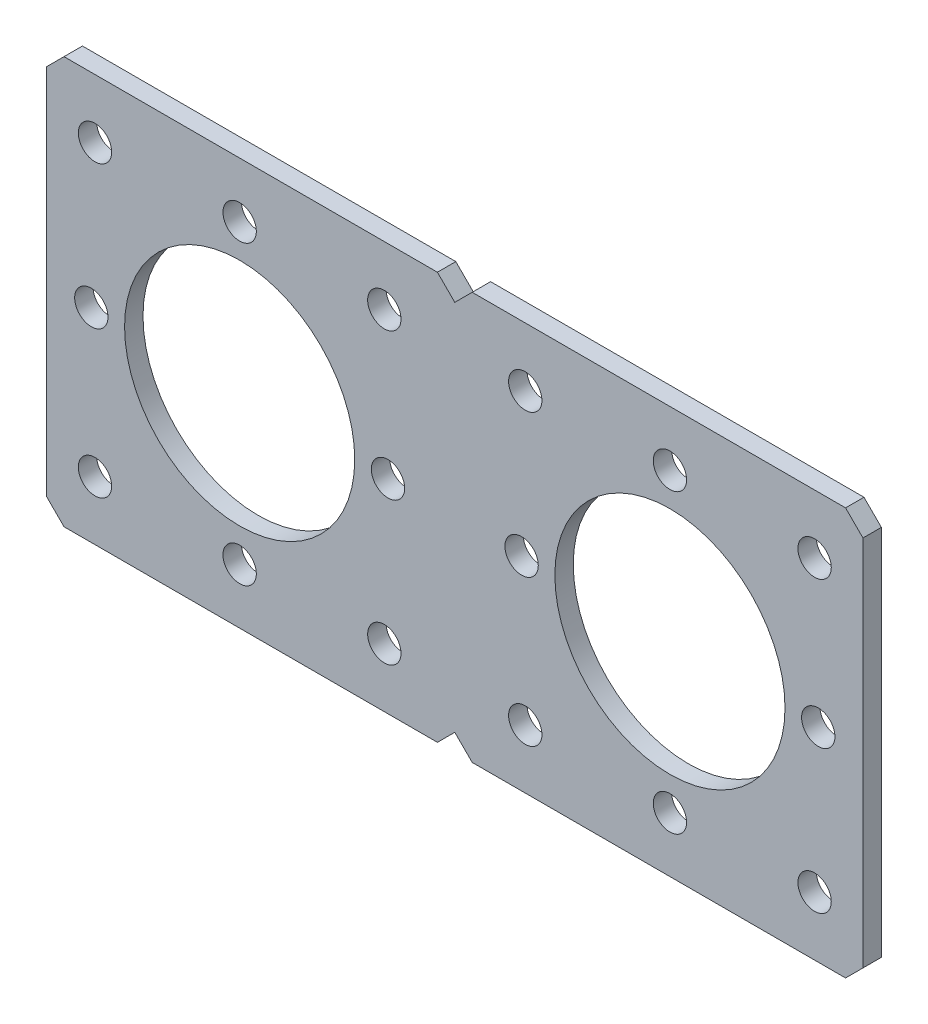
ISO-10303-21;
HEADER;
FILE_DESCRIPTION(('STEP AP214'),'2;1');
FILE_NAME('part.step','',(''),(''),'','','');
FILE_SCHEMA(('AUTOMOTIVE_DESIGN { 1 0 10303 214 1 1 1 1 }'));
ENDSEC;
DATA;
#1=APPLICATION_CONTEXT('core data for automotive mechanical design processes');
#2=APPLICATION_PROTOCOL_DEFINITION('international standard','automotive_design',2000,#1);
#3=PRODUCT_CONTEXT('',#1,'mechanical');
#4=PRODUCT('Part','Part','',(#3));
#5=PRODUCT_RELATED_PRODUCT_CATEGORY('part','',(#4));
#6=PRODUCT_DEFINITION_FORMATION('','',#4);
#7=PRODUCT_DEFINITION_CONTEXT('part definition',#1,'design');
#8=PRODUCT_DEFINITION('design','',#6,#7);
#9=PRODUCT_DEFINITION_SHAPE('','',#8);
#10=(LENGTH_UNIT() NAMED_UNIT(*) SI_UNIT(.MILLI.,.METRE.));
#11=(NAMED_UNIT(*) PLANE_ANGLE_UNIT() SI_UNIT($,.RADIAN.));
#12=(NAMED_UNIT(*) SI_UNIT($,.STERADIAN.) SOLID_ANGLE_UNIT());
#13=UNCERTAINTY_MEASURE_WITH_UNIT(LENGTH_MEASURE(1.E-05),#10,'distance_accuracy_value','');
#14=(GEOMETRIC_REPRESENTATION_CONTEXT(3) GLOBAL_UNCERTAINTY_ASSIGNED_CONTEXT((#13)) GLOBAL_UNIT_ASSIGNED_CONTEXT((#10,
#11,#12)) REPRESENTATION_CONTEXT('',''));
#15=CARTESIAN_POINT('',(0.,0.,0.));
#16=DIRECTION('',(0.,0.,1.));
#17=DIRECTION('',(1.,0.,0.));
#18=AXIS2_PLACEMENT_3D('',#15,#16,#17);
#19=CARTESIAN_POINT('',(2.159,-25.273,2.286));
#20=DIRECTION('',(-0.707106781186549,-0.707106781186546,0.));
#21=DIRECTION('',(0.707106781186546,-0.707106781186549,0.));
#22=AXIS2_PLACEMENT_3D('',#19,#20,#21);
#23=PLANE('',#22);
#24=DIRECTION('',(-0.707106781186546,0.707106781186549,0.));
#25=VECTOR('',#24,1.);
#26=CARTESIAN_POINT('',(2.159,-25.273,0.));
#27=LINE('',#26,#25);
#28=CARTESIAN_POINT('',(2.159,-25.273,0.));
#29=VERTEX_POINT('',#28);
#30=CARTESIAN_POINT('',(0.,-23.114,0.));
#31=VERTEX_POINT('',#30);
#32=EDGE_CURVE('E165',#29,#31,#27,.T.);
#33=ORIENTED_EDGE('',*,*,#32,.F.);
#34=DIRECTION('',(0.,0.,-1.));
#35=VECTOR('',#34,1.);
#36=CARTESIAN_POINT('',(2.159,-25.273,2.286));
#37=LINE('',#36,#35);
#38=CARTESIAN_POINT('',(2.159,-25.273,2.286));
#39=VERTEX_POINT('',#38);
#40=EDGE_CURVE('E11',#39,#29,#37,.T.);
#41=ORIENTED_EDGE('',*,*,#40,.F.);
#42=DIRECTION('',(-0.707106781186546,0.707106781186549,0.));
#43=VECTOR('',#42,1.);
#44=CARTESIAN_POINT('',(2.159,-25.273,2.286));
#45=LINE('',#44,#43);
#46=CARTESIAN_POINT('',(0.,-23.114,2.286));
#47=VERTEX_POINT('',#46);
#48=EDGE_CURVE('E204',#39,#47,#45,.T.);
#49=ORIENTED_EDGE('',*,*,#48,.T.);
#50=DIRECTION('',(0.,0.,-1.));
#51=VECTOR('',#50,1.);
#52=CARTESIAN_POINT('',(0.,-23.114,2.286));
#53=LINE('',#52,#51);
#54=EDGE_CURVE('E35',#47,#31,#53,.T.);
#55=ORIENTED_EDGE('',*,*,#54,.T.);
#56=EDGE_LOOP('',(#33,#41,#49,#55));
#57=FACE_BOUND('',#56,.T.);
#58=ADVANCED_FACE('F32',(#57),#23,.T.);
#59=CARTESIAN_POINT('',(48.514,-25.273,2.286));
#60=DIRECTION('',(0.,-1.,0.));
#61=DIRECTION('',(0.,0.,-1.));
#62=AXIS2_PLACEMENT_3D('',#59,#60,#61);
#63=PLANE('',#62);
#64=DIRECTION('',(-1.,0.,0.));
#65=VECTOR('',#64,1.);
#66=CARTESIAN_POINT('',(48.514,-25.273,0.));
#67=LINE('',#66,#65);
#68=CARTESIAN_POINT('',(48.514,-25.273,0.));
#69=VERTEX_POINT('',#68);
#70=EDGE_CURVE('E202',#69,#29,#67,.T.);
#71=ORIENTED_EDGE('',*,*,#70,.F.);
#72=DIRECTION('',(0.,0.,-1.));
#73=VECTOR('',#72,1.);
#74=CARTESIAN_POINT('',(48.514,-25.273,2.286));
#75=LINE('',#74,#73);
#76=CARTESIAN_POINT('',(48.514,-25.273,2.286));
#77=VERTEX_POINT('',#76);
#78=EDGE_CURVE('E41',#77,#69,#75,.T.);
#79=ORIENTED_EDGE('',*,*,#78,.F.);
#80=DIRECTION('',(-1.,0.,0.));
#81=VECTOR('',#80,1.);
#82=CARTESIAN_POINT('',(48.514,-25.273,2.286));
#83=LINE('',#82,#81);
#84=EDGE_CURVE('E155',#77,#39,#83,.T.);
#85=ORIENTED_EDGE('',*,*,#84,.T.);
#86=ORIENTED_EDGE('',*,*,#40,.T.);
#87=EDGE_LOOP('',(#71,#79,#85,#86));
#88=FACE_BOUND('',#87,.T.);
#89=ADVANCED_FACE('F228',(#88),#63,.T.);
#90=CARTESIAN_POINT('',(50.673,-23.114,2.286));
#91=DIRECTION('',(0.707106781186546,-0.707106781186549,0.));
#92=DIRECTION('',(0.707106781186549,0.707106781186546,0.));
#93=AXIS2_PLACEMENT_3D('',#90,#91,#92);
#94=PLANE('',#93);
#95=DIRECTION('',(-0.707106781186549,-0.707106781186546,0.));
#96=VECTOR('',#95,1.);
#97=CARTESIAN_POINT('',(50.673,-23.114,0.));
#98=LINE('',#97,#96);
#99=CARTESIAN_POINT('',(50.673,-23.114,0.));
#100=VERTEX_POINT('',#99);
#101=EDGE_CURVE('E142',#100,#69,#98,.T.);
#102=ORIENTED_EDGE('',*,*,#101,.F.);
#103=DIRECTION('',(0.,0.,-1.));
#104=VECTOR('',#103,1.);
#105=CARTESIAN_POINT('',(50.673,-23.114,2.286));
#106=LINE('',#105,#104);
#107=CARTESIAN_POINT('',(50.673,-23.114,2.286));
#108=VERTEX_POINT('',#107);
#109=EDGE_CURVE('E137',#108,#100,#106,.T.);
#110=ORIENTED_EDGE('',*,*,#109,.F.);
#111=DIRECTION('',(-0.707106781186549,-0.707106781186546,0.));
#112=VECTOR('',#111,1.);
#113=CARTESIAN_POINT('',(50.673,-23.114,2.286));
#114=LINE('',#113,#112);
#115=EDGE_CURVE('E140',#108,#77,#114,.T.);
#116=ORIENTED_EDGE('',*,*,#115,.T.);
#117=ORIENTED_EDGE('',*,*,#78,.T.);
#118=EDGE_LOOP('',(#102,#110,#116,#117));
#119=FACE_BOUND('',#118,.T.);
#120=ADVANCED_FACE('F139',(#119),#94,.T.);
#121=CARTESIAN_POINT('',(50.673,23.114,2.286));
#122=DIRECTION('',(1.,0.,0.));
#123=DIRECTION('',(0.,1.,0.));
#124=AXIS2_PLACEMENT_3D('',#121,#122,#123);
#125=PLANE('',#124);
#126=DIRECTION('',(0.,-1.,0.));
#127=VECTOR('',#126,1.);
#128=CARTESIAN_POINT('',(50.673,23.114,0.));
#129=LINE('',#128,#127);
#130=CARTESIAN_POINT('',(50.673,23.114,0.));
#131=VERTEX_POINT('',#130);
#132=EDGE_CURVE('E199',#131,#100,#129,.T.);
#133=ORIENTED_EDGE('',*,*,#132,.F.);
#134=DIRECTION('',(0.,0.,-1.));
#135=VECTOR('',#134,1.);
#136=CARTESIAN_POINT('',(50.673,23.114,2.286));
#137=LINE('',#136,#135);
#138=CARTESIAN_POINT('',(50.673,23.114,2.286));
#139=VERTEX_POINT('',#138);
#140=EDGE_CURVE('E147',#139,#131,#137,.T.);
#141=ORIENTED_EDGE('',*,*,#140,.F.);
#142=DIRECTION('',(0.,-1.,0.));
#143=VECTOR('',#142,1.);
#144=CARTESIAN_POINT('',(50.673,23.114,2.286));
#145=LINE('',#144,#143);
#146=EDGE_CURVE('E153',#139,#108,#145,.T.);
#147=ORIENTED_EDGE('',*,*,#146,.T.);
#148=ORIENTED_EDGE('',*,*,#109,.T.);
#149=EDGE_LOOP('',(#133,#141,#147,#148));
#150=FACE_BOUND('',#149,.T.);
#151=ADVANCED_FACE('F157',(#150),#125,.T.);
#152=CARTESIAN_POINT('',(48.514,25.273,2.286));
#153=DIRECTION('',(0.707106781186548,0.707106781186548,0.));
#154=DIRECTION('',(-0.707106781186548,0.707106781186548,0.));
#155=AXIS2_PLACEMENT_3D('',#152,#153,#154);
#156=PLANE('',#155);
#157=DIRECTION('',(0.707106781186548,-0.707106781186548,0.));
#158=VECTOR('',#157,1.);
#159=CARTESIAN_POINT('',(48.514,25.273,0.));
#160=LINE('',#159,#158);
#161=CARTESIAN_POINT('',(48.514,25.273,0.));
#162=VERTEX_POINT('',#161);
#163=EDGE_CURVE('E196',#162,#131,#160,.T.);
#164=ORIENTED_EDGE('',*,*,#163,.F.);
#165=DIRECTION('',(0.,0.,-1.));
#166=VECTOR('',#165,1.);
#167=CARTESIAN_POINT('',(48.514,25.273,2.286));
#168=LINE('',#167,#166);
#169=CARTESIAN_POINT('',(48.514,25.273,2.286));
#170=VERTEX_POINT('',#169);
#171=EDGE_CURVE('E208',#170,#162,#168,.T.);
#172=ORIENTED_EDGE('',*,*,#171,.F.);
#173=DIRECTION('',(0.707106781186548,-0.707106781186548,0.));
#174=VECTOR('',#173,1.);
#175=CARTESIAN_POINT('',(48.514,25.273,2.286));
#176=LINE('',#175,#174);
#177=EDGE_CURVE('E158',#170,#139,#176,.T.);
#178=ORIENTED_EDGE('',*,*,#177,.T.);
#179=ORIENTED_EDGE('',*,*,#140,.T.);
#180=EDGE_LOOP('',(#164,#172,#178,#179));
#181=FACE_BOUND('',#180,.T.);
#182=ADVANCED_FACE('F241',(#181),#156,.T.);
#183=CARTESIAN_POINT('',(2.15899999999998,25.273,2.286));
#184=DIRECTION('',(0.,1.,0.));
#185=DIRECTION('',(0.,0.,1.));
#186=AXIS2_PLACEMENT_3D('',#183,#184,#185);
#187=PLANE('',#186);
#188=DIRECTION('',(1.,0.,0.));
#189=VECTOR('',#188,1.);
#190=CARTESIAN_POINT('',(2.15899999999998,25.273,0.));
#191=LINE('',#190,#189);
#192=CARTESIAN_POINT('',(2.15899999999998,25.273,0.));
#193=VERTEX_POINT('',#192);
#194=EDGE_CURVE('E193',#193,#162,#191,.T.);
#195=ORIENTED_EDGE('',*,*,#194,.F.);
#196=DIRECTION('',(0.,0.,-1.));
#197=VECTOR('',#196,1.);
#198=CARTESIAN_POINT('',(2.15899999999998,25.273,2.286));
#199=LINE('',#198,#197);
#200=CARTESIAN_POINT('',(2.15899999999998,25.273,2.286));
#201=VERTEX_POINT('',#200);
#202=EDGE_CURVE('E210',#201,#193,#199,.T.);
#203=ORIENTED_EDGE('',*,*,#202,.F.);
#204=DIRECTION('',(1.,0.,0.));
#205=VECTOR('',#204,1.);
#206=CARTESIAN_POINT('',(2.15899999999998,25.273,2.286));
#207=LINE('',#206,#205);
#208=EDGE_CURVE('E160',#201,#170,#207,.T.);
#209=ORIENTED_EDGE('',*,*,#208,.T.);
#210=ORIENTED_EDGE('',*,*,#171,.T.);
#211=EDGE_LOOP('',(#195,#203,#209,#210));
#212=FACE_BOUND('',#211,.T.);
#213=ADVANCED_FACE('F244',(#212),#187,.T.);
#214=CARTESIAN_POINT('',(0.,23.114,2.286));
#215=DIRECTION('',(-0.70710678118655,0.707106781186545,0.));
#216=DIRECTION('',(-0.707106781186545,-0.70710678118655,0.));
#217=AXIS2_PLACEMENT_3D('',#214,#215,#216);
#218=PLANE('',#217);
#219=DIRECTION('',(0.707106781186545,0.70710678118655,0.));
#220=VECTOR('',#219,1.);
#221=CARTESIAN_POINT('',(0.,23.114,0.));
#222=LINE('',#221,#220);
#223=CARTESIAN_POINT('',(0.,23.114,0.));
#224=VERTEX_POINT('',#223);
#225=EDGE_CURVE('E190',#224,#193,#222,.T.);
#226=ORIENTED_EDGE('',*,*,#225,.F.);
#227=DIRECTION('',(0.,0.,-1.));
#228=VECTOR('',#227,1.);
#229=CARTESIAN_POINT('',(0.,23.114,2.286));
#230=LINE('',#229,#228);
#231=CARTESIAN_POINT('',(0.,23.114,2.286));
#232=VERTEX_POINT('',#231);
#233=EDGE_CURVE('E212',#232,#224,#230,.T.);
#234=ORIENTED_EDGE('',*,*,#233,.F.);
#235=DIRECTION('',(0.707106781186545,0.70710678118655,0.));
#236=VECTOR('',#235,1.);
#237=CARTESIAN_POINT('',(0.,23.114,2.286));
#238=LINE('',#237,#236);
#239=EDGE_CURVE('E492',#232,#201,#238,.T.);
#240=ORIENTED_EDGE('',*,*,#239,.T.);
#241=ORIENTED_EDGE('',*,*,#202,.T.);
#242=EDGE_LOOP('',(#226,#234,#240,#241));
#243=FACE_BOUND('',#242,.T.);
#244=ADVANCED_FACE('F248',(#243),#218,.T.);
#245=CARTESIAN_POINT('',(-2.15900000000001,25.273,2.286));
#246=DIRECTION('',(0.707106781186547,0.707106781186548,0.));
#247=DIRECTION('',(-0.707106781186548,0.707106781186547,0.));
#248=AXIS2_PLACEMENT_3D('',#245,#246,#247);
#249=PLANE('',#248);
#250=DIRECTION('',(0.707106781186548,-0.707106781186547,0.));
#251=VECTOR('',#250,1.);
#252=CARTESIAN_POINT('',(-2.15900000000001,25.273,0.));
#253=LINE('',#252,#251);
#254=CARTESIAN_POINT('',(-2.15900000000001,25.273,0.));
#255=VERTEX_POINT('',#254);
#256=EDGE_CURVE('E187',#255,#224,#253,.T.);
#257=ORIENTED_EDGE('',*,*,#256,.F.);
#258=DIRECTION('',(0.,0.,-1.));
#259=VECTOR('',#258,1.);
#260=CARTESIAN_POINT('',(-2.15900000000001,25.273,2.286));
#261=LINE('',#260,#259);
#262=CARTESIAN_POINT('',(-2.15900000000001,25.273,2.286));
#263=VERTEX_POINT('',#262);
#264=EDGE_CURVE('E214',#263,#255,#261,.T.);
#265=ORIENTED_EDGE('',*,*,#264,.F.);
#266=DIRECTION('',(0.707106781186548,-0.707106781186547,0.));
#267=VECTOR('',#266,1.);
#268=CARTESIAN_POINT('',(-2.15900000000001,25.273,2.286));
#269=LINE('',#268,#267);
#270=EDGE_CURVE('E489',#263,#232,#269,.T.);
#271=ORIENTED_EDGE('',*,*,#270,.T.);
#272=ORIENTED_EDGE('',*,*,#233,.T.);
#273=EDGE_LOOP('',(#257,#265,#271,#272));
#274=FACE_BOUND('',#273,.T.);
#275=ADVANCED_FACE('F252',(#274),#249,.T.);
#276=CARTESIAN_POINT('',(-48.514,25.273,2.286));
#277=DIRECTION('',(0.,1.,0.));
#278=DIRECTION('',(-1.,0.,0.));
#279=AXIS2_PLACEMENT_3D('',#276,#277,#278);
#280=PLANE('',#279);
#281=DIRECTION('',(1.,0.,0.));
#282=VECTOR('',#281,1.);
#283=CARTESIAN_POINT('',(-48.514,25.273,0.));
#284=LINE('',#283,#282);
#285=CARTESIAN_POINT('',(-48.514,25.273,0.));
#286=VERTEX_POINT('',#285);
#287=EDGE_CURVE('E184',#286,#255,#284,.T.);
#288=ORIENTED_EDGE('',*,*,#287,.F.);
#289=DIRECTION('',(0.,0.,-1.));
#290=VECTOR('',#289,1.);
#291=CARTESIAN_POINT('',(-48.514,25.273,2.286));
#292=LINE('',#291,#290);
#293=CARTESIAN_POINT('',(-48.514,25.273,2.286));
#294=VERTEX_POINT('',#293);
#295=EDGE_CURVE('E216',#294,#286,#292,.T.);
#296=ORIENTED_EDGE('',*,*,#295,.F.);
#297=DIRECTION('',(1.,0.,0.));
#298=VECTOR('',#297,1.);
#299=CARTESIAN_POINT('',(-48.514,25.273,2.286));
#300=LINE('',#299,#298);
#301=EDGE_CURVE('E486',#294,#263,#300,.T.);
#302=ORIENTED_EDGE('',*,*,#301,.T.);
#303=ORIENTED_EDGE('',*,*,#264,.T.);
#304=EDGE_LOOP('',(#288,#296,#302,#303));
#305=FACE_BOUND('',#304,.T.);
#306=ADVANCED_FACE('F256',(#305),#280,.T.);
#307=CARTESIAN_POINT('',(-50.673,23.114,2.286));
#308=DIRECTION('',(-0.707106781186546,0.707106781186549,0.));
#309=DIRECTION('',(-0.707106781186549,-0.707106781186546,0.));
#310=AXIS2_PLACEMENT_3D('',#307,#308,#309);
#311=PLANE('',#310);
#312=DIRECTION('',(0.707106781186549,0.707106781186546,0.));
#313=VECTOR('',#312,1.);
#314=CARTESIAN_POINT('',(-50.673,23.114,0.));
#315=LINE('',#314,#313);
#316=CARTESIAN_POINT('',(-50.673,23.114,0.));
#317=VERTEX_POINT('',#316);
#318=EDGE_CURVE('E181',#317,#286,#315,.T.);
#319=ORIENTED_EDGE('',*,*,#318,.F.);
#320=DIRECTION('',(0.,0.,-1.));
#321=VECTOR('',#320,1.);
#322=CARTESIAN_POINT('',(-50.673,23.114,2.286));
#323=LINE('',#322,#321);
#324=CARTESIAN_POINT('',(-50.673,23.114,2.286));
#325=VERTEX_POINT('',#324);
#326=EDGE_CURVE('E218',#325,#317,#323,.T.);
#327=ORIENTED_EDGE('',*,*,#326,.F.);
#328=DIRECTION('',(0.707106781186549,0.707106781186546,0.));
#329=VECTOR('',#328,1.);
#330=CARTESIAN_POINT('',(-50.673,23.114,2.286));
#331=LINE('',#330,#329);
#332=EDGE_CURVE('E483',#325,#294,#331,.T.);
#333=ORIENTED_EDGE('',*,*,#332,.T.);
#334=ORIENTED_EDGE('',*,*,#295,.T.);
#335=EDGE_LOOP('',(#319,#327,#333,#334));
#336=FACE_BOUND('',#335,.T.);
#337=ADVANCED_FACE('F260',(#336),#311,.T.);
#338=CARTESIAN_POINT('',(-50.673,-23.114,2.286));
#339=DIRECTION('',(-1.,0.,0.));
#340=DIRECTION('',(0.,0.,1.));
#341=AXIS2_PLACEMENT_3D('',#338,#339,#340);
#342=PLANE('',#341);
#343=DIRECTION('',(0.,1.,0.));
#344=VECTOR('',#343,1.);
#345=CARTESIAN_POINT('',(-50.673,-23.114,0.));
#346=LINE('',#345,#344);
#347=CARTESIAN_POINT('',(-50.673,-23.114,0.));
#348=VERTEX_POINT('',#347);
#349=EDGE_CURVE('E178',#348,#317,#346,.T.);
#350=ORIENTED_EDGE('',*,*,#349,.F.);
#351=DIRECTION('',(0.,0.,-1.));
#352=VECTOR('',#351,1.);
#353=CARTESIAN_POINT('',(-50.673,-23.114,2.286));
#354=LINE('',#353,#352);
#355=CARTESIAN_POINT('',(-50.673,-23.114,2.286));
#356=VERTEX_POINT('',#355);
#357=EDGE_CURVE('E220',#356,#348,#354,.T.);
#358=ORIENTED_EDGE('',*,*,#357,.F.);
#359=DIRECTION('',(0.,1.,0.));
#360=VECTOR('',#359,1.);
#361=CARTESIAN_POINT('',(-50.673,-23.114,2.286));
#362=LINE('',#361,#360);
#363=EDGE_CURVE('E480',#356,#325,#362,.T.);
#364=ORIENTED_EDGE('',*,*,#363,.T.);
#365=ORIENTED_EDGE('',*,*,#326,.T.);
#366=EDGE_LOOP('',(#350,#358,#364,#365));
#367=FACE_BOUND('',#366,.T.);
#368=ADVANCED_FACE('F264',(#367),#342,.T.);
#369=CARTESIAN_POINT('',(-48.514,-25.273,2.286));
#370=DIRECTION('',(-0.707106781186549,-0.707106781186546,0.));
#371=DIRECTION('',(0.707106781186546,-0.707106781186549,0.));
#372=AXIS2_PLACEMENT_3D('',#369,#370,#371);
#373=PLANE('',#372);
#374=DIRECTION('',(-0.707106781186546,0.707106781186549,0.));
#375=VECTOR('',#374,1.);
#376=CARTESIAN_POINT('',(-48.514,-25.273,0.));
#377=LINE('',#376,#375);
#378=CARTESIAN_POINT('',(-48.514,-25.273,0.));
#379=VERTEX_POINT('',#378);
#380=EDGE_CURVE('E175',#379,#348,#377,.T.);
#381=ORIENTED_EDGE('',*,*,#380,.F.);
#382=DIRECTION('',(0.,0.,-1.));
#383=VECTOR('',#382,1.);
#384=CARTESIAN_POINT('',(-48.514,-25.273,2.286));
#385=LINE('',#384,#383);
#386=CARTESIAN_POINT('',(-48.514,-25.273,2.286));
#387=VERTEX_POINT('',#386);
#388=EDGE_CURVE('E222',#387,#379,#385,.T.);
#389=ORIENTED_EDGE('',*,*,#388,.F.);
#390=DIRECTION('',(-0.707106781186546,0.707106781186549,0.));
#391=VECTOR('',#390,1.);
#392=CARTESIAN_POINT('',(-48.514,-25.273,2.286));
#393=LINE('',#392,#391);
#394=EDGE_CURVE('E477',#387,#356,#393,.T.);
#395=ORIENTED_EDGE('',*,*,#394,.T.);
#396=ORIENTED_EDGE('',*,*,#357,.T.);
#397=EDGE_LOOP('',(#381,#389,#395,#396));
#398=FACE_BOUND('',#397,.T.);
#399=ADVANCED_FACE('F268',(#398),#373,.T.);
#400=CARTESIAN_POINT('',(-2.15899999999998,-25.273,2.286));
#401=DIRECTION('',(0.,-1.,0.));
#402=DIRECTION('',(0.,0.,-1.));
#403=AXIS2_PLACEMENT_3D('',#400,#401,#402);
#404=PLANE('',#403);
#405=DIRECTION('',(-1.,0.,0.));
#406=VECTOR('',#405,1.);
#407=CARTESIAN_POINT('',(-2.15899999999998,-25.273,0.));
#408=LINE('',#407,#406);
#409=CARTESIAN_POINT('',(-2.15899999999998,-25.273,0.));
#410=VERTEX_POINT('',#409);
#411=EDGE_CURVE('E172',#410,#379,#408,.T.);
#412=ORIENTED_EDGE('',*,*,#411,.F.);
#413=DIRECTION('',(0.,0.,-1.));
#414=VECTOR('',#413,1.);
#415=CARTESIAN_POINT('',(-2.15899999999998,-25.273,2.286));
#416=LINE('',#415,#414);
#417=CARTESIAN_POINT('',(-2.15899999999998,-25.273,2.286));
#418=VERTEX_POINT('',#417);
#419=EDGE_CURVE('E223',#418,#410,#416,.T.);
#420=ORIENTED_EDGE('',*,*,#419,.F.);
#421=DIRECTION('',(-1.,0.,0.));
#422=VECTOR('',#421,1.);
#423=CARTESIAN_POINT('',(-2.15899999999998,-25.273,2.286));
#424=LINE('',#423,#422);
#425=EDGE_CURVE('E474',#418,#387,#424,.T.);
#426=ORIENTED_EDGE('',*,*,#425,.T.);
#427=ORIENTED_EDGE('',*,*,#388,.T.);
#428=EDGE_LOOP('',(#412,#420,#426,#427));
#429=FACE_BOUND('',#428,.T.);
#430=ADVANCED_FACE('F272',(#429),#404,.T.);
#431=CARTESIAN_POINT('',(0.,-23.114,2.286));
#432=DIRECTION('',(0.707106781186548,-0.707106781186547,0.));
#433=DIRECTION('',(0.707106781186547,0.707106781186548,0.));
#434=AXIS2_PLACEMENT_3D('',#431,#432,#433);
#435=PLANE('',#434);
#436=DIRECTION('',(-0.707106781186547,-0.707106781186548,0.));
#437=VECTOR('',#436,1.);
#438=CARTESIAN_POINT('',(0.,-23.114,0.));
#439=LINE('',#438,#437);
#440=EDGE_CURVE('E168',#31,#410,#439,.T.);
#441=ORIENTED_EDGE('',*,*,#440,.F.);
#442=ORIENTED_EDGE('',*,*,#54,.F.);
#443=DIRECTION('',(-0.707106781186547,-0.707106781186548,0.));
#444=VECTOR('',#443,1.);
#445=CARTESIAN_POINT('',(0.,-23.114,2.286));
#446=LINE('',#445,#444);
#447=EDGE_CURVE('E472',#47,#418,#446,.T.);
#448=ORIENTED_EDGE('',*,*,#447,.T.);
#449=ORIENTED_EDGE('',*,*,#419,.T.);
#450=EDGE_LOOP('',(#441,#442,#448,#449));
#451=FACE_BOUND('',#450,.T.);
#452=ADVANCED_FACE('F225',(#451),#435,.T.);
#453=CARTESIAN_POINT('',(0.,0.,2.286));
#454=DIRECTION('',(0.,0.,1.));
#455=DIRECTION('',(1.,0.,0.));
#456=AXIS2_PLACEMENT_3D('',#453,#454,#455);
#457=PLANE('',#456);
#458=CARTESIAN_POINT('',(26.7081,-18.415,2.286));
#459=DIRECTION('',(0.,0.,-1.));
#460=DIRECTION('',(1.,0.,0.));
#461=AXIS2_PLACEMENT_3D('',#458,#459,#460);
#462=CIRCLE('',#461,2.0701);
#463=CARTESIAN_POINT('',(28.7782,-18.415,2.286));
#464=VERTEX_POINT('',#463);
#465=EDGE_CURVE('E363',#464,#464,#462,.T.);
#466=ORIENTED_EDGE('',*,*,#465,.T.);
#467=EDGE_LOOP('',(#466));
#468=FACE_BOUND('',#467,.T.);
#469=CARTESIAN_POINT('',(-8.2931,-1.87350135405495E-13,2.286));
#470=DIRECTION('',(0.,0.,-1.));
#471=DIRECTION('',(1.,0.,0.));
#472=AXIS2_PLACEMENT_3D('',#469,#470,#471);
#473=CIRCLE('',#472,2.0701);
#474=CARTESIAN_POINT('',(-6.223,-1.87350135405495E-13,2.286));
#475=VERTEX_POINT('',#474);
#476=EDGE_CURVE('E371',#475,#475,#473,.T.);
#477=ORIENTED_EDGE('',*,*,#476,.T.);
#478=EDGE_LOOP('',(#477));
#479=FACE_BOUND('',#478,.T.);
#480=CARTESIAN_POINT('',(-45.1231,0.,2.286));
#481=DIRECTION('',(0.,0.,-1.));
#482=DIRECTION('',(1.,0.,0.));
#483=AXIS2_PLACEMENT_3D('',#480,#481,#482);
#484=CIRCLE('',#483,2.07010000000001);
#485=CARTESIAN_POINT('',(-43.053,0.,2.286));
#486=VERTEX_POINT('',#485);
#487=EDGE_CURVE('E377',#486,#486,#484,.T.);
#488=ORIENTED_EDGE('',*,*,#487,.T.);
#489=EDGE_LOOP('',(#488));
#490=FACE_BOUND('',#489,.T.);
#491=CARTESIAN_POINT('',(8.29310000000001,-1.73472347597681E-13,2.286));
#492=DIRECTION('',(0.,0.,-1.));
#493=DIRECTION('',(1.,0.,0.));
#494=AXIS2_PLACEMENT_3D('',#491,#492,#493);
#495=CIRCLE('',#494,2.0701);
#496=CARTESIAN_POINT('',(10.3632,-1.73472347597681E-13,2.286));
#497=VERTEX_POINT('',#496);
#498=EDGE_CURVE('E383',#497,#497,#495,.T.);
#499=ORIENTED_EDGE('',*,*,#498,.T.);
#500=EDGE_LOOP('',(#499));
#501=FACE_BOUND('',#500,.T.);
#502=CARTESIAN_POINT('',(-8.7475877578617,-17.9605122421383,2.286));
#503=DIRECTION('',(0.,0.,-1.));
#504=DIRECTION('',(1.,0.,0.));
#505=AXIS2_PLACEMENT_3D('',#502,#503,#504);
#506=CIRCLE('',#505,2.0701);
#507=CARTESIAN_POINT('',(-6.6774877578617,-17.9605122421383,2.286));
#508=VERTEX_POINT('',#507);
#509=EDGE_CURVE('E389',#508,#508,#506,.T.);
#510=ORIENTED_EDGE('',*,*,#509,.T.);
#511=EDGE_LOOP('',(#510));
#512=FACE_BOUND('',#511,.T.);
#513=CARTESIAN_POINT('',(-44.6686122421382,-17.9605122421383,2.286));
#514=DIRECTION('',(0.,0.,-1.));
#515=DIRECTION('',(1.,0.,0.));
#516=AXIS2_PLACEMENT_3D('',#513,#514,#515);
#517=CIRCLE('',#516,2.0701);
#518=CARTESIAN_POINT('',(-42.5985122421382,-17.9605122421383,2.286));
#519=VERTEX_POINT('',#518);
#520=EDGE_CURVE('E395',#519,#519,#517,.T.);
#521=ORIENTED_EDGE('',*,*,#520,.T.);
#522=EDGE_LOOP('',(#521));
#523=FACE_BOUND('',#522,.T.);
#524=CARTESIAN_POINT('',(44.6686122421383,17.9605122421382,2.286));
#525=DIRECTION('',(0.,0.,-1.));
#526=DIRECTION('',(1.,0.,0.));
#527=AXIS2_PLACEMENT_3D('',#524,#525,#526);
#528=CIRCLE('',#527,2.0701);
#529=CARTESIAN_POINT('',(46.7387122421383,17.9605122421382,2.286));
#530=VERTEX_POINT('',#529);
#531=EDGE_CURVE('E401',#530,#530,#528,.T.);
#532=ORIENTED_EDGE('',*,*,#531,.T.);
#533=EDGE_LOOP('',(#532));
#534=FACE_BOUND('',#533,.T.);
#535=CARTESIAN_POINT('',(8.74758775786161,-17.9605122421383,2.286));
#536=DIRECTION('',(0.,0.,-1.));
#537=DIRECTION('',(1.,0.,0.));
#538=AXIS2_PLACEMENT_3D('',#535,#536,#537);
#539=CIRCLE('',#538,2.0701);
#540=CARTESIAN_POINT('',(10.8176877578616,-17.9605122421383,2.286));
#541=VERTEX_POINT('',#540);
#542=EDGE_CURVE('E407',#541,#541,#539,.T.);
#543=ORIENTED_EDGE('',*,*,#542,.T.);
#544=EDGE_LOOP('',(#543));
#545=FACE_BOUND('',#544,.T.);
#546=CARTESIAN_POINT('',(26.7081,0.,2.286));
#547=DIRECTION('',(0.,0.,-1.));
#548=DIRECTION('',(1.,0.,0.));
#549=AXIS2_PLACEMENT_3D('',#546,#547,#548);
#550=CIRCLE('',#549,14.2875);
#551=CARTESIAN_POINT('',(40.9956,0.,2.286));
#552=VERTEX_POINT('',#551);
#553=EDGE_CURVE('E413',#552,#552,#550,.T.);
#554=ORIENTED_EDGE('',*,*,#553,.T.);
#555=EDGE_LOOP('',(#554));
#556=FACE_BOUND('',#555,.T.);
#557=CARTESIAN_POINT('',(8.74758775786166,17.9605122421383,2.286));
#558=DIRECTION('',(0.,0.,-1.));
#559=DIRECTION('',(1.,0.,0.));
#560=AXIS2_PLACEMENT_3D('',#557,#558,#559);
#561=CIRCLE('',#560,2.0701);
#562=CARTESIAN_POINT('',(10.8176877578617,17.9605122421383,2.286));
#563=VERTEX_POINT('',#562);
#564=EDGE_CURVE('E419',#563,#563,#561,.T.);
#565=ORIENTED_EDGE('',*,*,#564,.T.);
#566=EDGE_LOOP('',(#565));
#567=FACE_BOUND('',#566,.T.);
#568=CARTESIAN_POINT('',(44.6686122421383,-17.9605122421383,2.286));
#569=DIRECTION('',(0.,0.,-1.));
#570=DIRECTION('',(1.,0.,0.));
#571=AXIS2_PLACEMENT_3D('',#568,#569,#570);
#572=CIRCLE('',#571,2.0701);
#573=CARTESIAN_POINT('',(46.7387122421383,-17.9605122421383,2.286));
#574=VERTEX_POINT('',#573);
#575=EDGE_CURVE('E425',#574,#574,#572,.T.);
#576=ORIENTED_EDGE('',*,*,#575,.T.);
#577=EDGE_LOOP('',(#576));
#578=FACE_BOUND('',#577,.T.);
#579=CARTESIAN_POINT('',(-26.7081,0.,2.286));
#580=DIRECTION('',(0.,0.,-1.));
#581=DIRECTION('',(1.,0.,0.));
#582=AXIS2_PLACEMENT_3D('',#579,#580,#581);
#583=CIRCLE('',#582,14.2875);
#584=CARTESIAN_POINT('',(-12.4206,0.,2.286));
#585=VERTEX_POINT('',#584);
#586=EDGE_CURVE('E431',#585,#585,#583,.T.);
#587=ORIENTED_EDGE('',*,*,#586,.T.);
#588=EDGE_LOOP('',(#587));
#589=FACE_BOUND('',#588,.T.);
#590=CARTESIAN_POINT('',(-44.6686122421384,17.9605122421382,2.286));
#591=DIRECTION('',(0.,0.,-1.));
#592=DIRECTION('',(1.,0.,0.));
#593=AXIS2_PLACEMENT_3D('',#590,#591,#592);
#594=CIRCLE('',#593,2.0701);
#595=CARTESIAN_POINT('',(-42.5985122421384,17.9605122421382,2.286));
#596=VERTEX_POINT('',#595);
#597=EDGE_CURVE('E437',#596,#596,#594,.T.);
#598=ORIENTED_EDGE('',*,*,#597,.T.);
#599=EDGE_LOOP('',(#598));
#600=FACE_BOUND('',#599,.T.);
#601=CARTESIAN_POINT('',(-8.74758775786172,17.9605122421382,2.286));
#602=DIRECTION('',(0.,0.,-1.));
#603=DIRECTION('',(1.,0.,0.));
#604=AXIS2_PLACEMENT_3D('',#601,#602,#603);
#605=CIRCLE('',#604,2.0701);
#606=CARTESIAN_POINT('',(-6.67748775786172,17.9605122421382,2.286));
#607=VERTEX_POINT('',#606);
#608=EDGE_CURVE('E443',#607,#607,#605,.T.);
#609=ORIENTED_EDGE('',*,*,#608,.T.);
#610=EDGE_LOOP('',(#609));
#611=FACE_BOUND('',#610,.T.);
#612=CARTESIAN_POINT('',(26.7080999999999,18.415,2.286));
#613=DIRECTION('',(0.,0.,-1.));
#614=DIRECTION('',(1.,0.,0.));
#615=AXIS2_PLACEMENT_3D('',#612,#613,#614);
#616=CIRCLE('',#615,2.0701);
#617=CARTESIAN_POINT('',(28.7781999999999,18.415,2.286));
#618=VERTEX_POINT('',#617);
#619=EDGE_CURVE('E449',#618,#618,#616,.T.);
#620=ORIENTED_EDGE('',*,*,#619,.T.);
#621=EDGE_LOOP('',(#620));
#622=FACE_BOUND('',#621,.T.);
#623=CARTESIAN_POINT('',(-26.7080999999999,18.415,2.286));
#624=DIRECTION('',(0.,0.,-1.));
#625=DIRECTION('',(1.,0.,0.));
#626=AXIS2_PLACEMENT_3D('',#623,#624,#625);
#627=CIRCLE('',#626,2.0701);
#628=CARTESIAN_POINT('',(-24.6379999999999,18.415,2.286));
#629=VERTEX_POINT('',#628);
#630=EDGE_CURVE('E455',#629,#629,#627,.T.);
#631=ORIENTED_EDGE('',*,*,#630,.T.);
#632=EDGE_LOOP('',(#631));
#633=FACE_BOUND('',#632,.T.);
#634=CARTESIAN_POINT('',(45.1231,0.,2.286));
#635=DIRECTION('',(0.,0.,-1.));
#636=DIRECTION('',(1.,0.,0.));
#637=AXIS2_PLACEMENT_3D('',#634,#635,#636);
#638=CIRCLE('',#637,2.07010000000001);
#639=CARTESIAN_POINT('',(47.1932,0.,2.286));
#640=VERTEX_POINT('',#639);
#641=EDGE_CURVE('E461',#640,#640,#638,.T.);
#642=ORIENTED_EDGE('',*,*,#641,.T.);
#643=EDGE_LOOP('',(#642));
#644=FACE_BOUND('',#643,.T.);
#645=CARTESIAN_POINT('',(-26.7081,-18.415,2.286));
#646=DIRECTION('',(0.,0.,-1.));
#647=DIRECTION('',(1.,0.,0.));
#648=AXIS2_PLACEMENT_3D('',#645,#646,#647);
#649=CIRCLE('',#648,2.0701);
#650=CARTESIAN_POINT('',(-24.638,-18.415,2.286));
#651=VERTEX_POINT('',#650);
#652=EDGE_CURVE('E169',#651,#651,#649,.T.);
#653=ORIENTED_EDGE('',*,*,#652,.T.);
#654=EDGE_LOOP('',(#653));
#655=FACE_BOUND('',#654,.T.);
#656=ORIENTED_EDGE('',*,*,#48,.F.);
#657=ORIENTED_EDGE('',*,*,#84,.F.);
#658=ORIENTED_EDGE('',*,*,#115,.F.);
#659=ORIENTED_EDGE('',*,*,#146,.F.);
#660=ORIENTED_EDGE('',*,*,#177,.F.);
#661=ORIENTED_EDGE('',*,*,#208,.F.);
#662=ORIENTED_EDGE('',*,*,#239,.F.);
#663=ORIENTED_EDGE('',*,*,#270,.F.);
#664=ORIENTED_EDGE('',*,*,#301,.F.);
#665=ORIENTED_EDGE('',*,*,#332,.F.);
#666=ORIENTED_EDGE('',*,*,#363,.F.);
#667=ORIENTED_EDGE('',*,*,#394,.F.);
#668=ORIENTED_EDGE('',*,*,#425,.F.);
#669=ORIENTED_EDGE('',*,*,#447,.F.);
#670=EDGE_LOOP('',(#656,#657,#658,#659,#660,#661,#662,#663,#664,#665,#666,#667,#668,#669));
#671=FACE_BOUND('',#670,.T.);
#672=ADVANCED_FACE('F151',(#468,#479,#490,#501,#512,#523,#534,#545,#556,#567,#578,#589,#600,
#611,#622,#633,#644,#655,#671),#457,.T.);
#673=CARTESIAN_POINT('',(0.,0.,0.));
#674=DIRECTION('',(0.,0.,1.));
#675=DIRECTION('',(1.,0.,0.));
#676=AXIS2_PLACEMENT_3D('',#673,#674,#675);
#677=PLANE('',#676);
#678=CARTESIAN_POINT('',(26.7081,-18.415,0.));
#679=DIRECTION('',(0.,0.,-1.));
#680=DIRECTION('',(1.,0.,0.));
#681=AXIS2_PLACEMENT_3D('',#678,#679,#680);
#682=CIRCLE('',#681,2.0701);
#683=CARTESIAN_POINT('',(28.7782,-18.415,0.));
#684=VERTEX_POINT('',#683);
#685=EDGE_CURVE('E366',#684,#684,#682,.T.);
#686=ORIENTED_EDGE('',*,*,#685,.F.);
#687=EDGE_LOOP('',(#686));
#688=FACE_BOUND('',#687,.T.);
#689=CARTESIAN_POINT('',(-8.2931,-1.87350135405495E-13,0.));
#690=DIRECTION('',(0.,0.,-1.));
#691=DIRECTION('',(1.,0.,0.));
#692=AXIS2_PLACEMENT_3D('',#689,#690,#691);
#693=CIRCLE('',#692,2.0701);
#694=CARTESIAN_POINT('',(-6.223,-1.87350135405495E-13,0.));
#695=VERTEX_POINT('',#694);
#696=EDGE_CURVE('E368',#695,#695,#693,.T.);
#697=ORIENTED_EDGE('',*,*,#696,.F.);
#698=EDGE_LOOP('',(#697));
#699=FACE_BOUND('',#698,.T.);
#700=CARTESIAN_POINT('',(-45.1231,0.,0.));
#701=DIRECTION('',(0.,0.,-1.));
#702=DIRECTION('',(1.,0.,0.));
#703=AXIS2_PLACEMENT_3D('',#700,#701,#702);
#704=CIRCLE('',#703,2.07010000000001);
#705=CARTESIAN_POINT('',(-43.053,0.,0.));
#706=VERTEX_POINT('',#705);
#707=EDGE_CURVE('E374',#706,#706,#704,.T.);
#708=ORIENTED_EDGE('',*,*,#707,.F.);
#709=EDGE_LOOP('',(#708));
#710=FACE_BOUND('',#709,.T.);
#711=CARTESIAN_POINT('',(8.29310000000001,-1.73472347597681E-13,0.));
#712=DIRECTION('',(0.,0.,-1.));
#713=DIRECTION('',(1.,0.,0.));
#714=AXIS2_PLACEMENT_3D('',#711,#712,#713);
#715=CIRCLE('',#714,2.0701);
#716=CARTESIAN_POINT('',(10.3632,-1.73472347597681E-13,0.));
#717=VERTEX_POINT('',#716);
#718=EDGE_CURVE('E380',#717,#717,#715,.T.);
#719=ORIENTED_EDGE('',*,*,#718,.F.);
#720=EDGE_LOOP('',(#719));
#721=FACE_BOUND('',#720,.T.);
#722=CARTESIAN_POINT('',(-8.7475877578617,-17.9605122421383,0.));
#723=DIRECTION('',(0.,0.,-1.));
#724=DIRECTION('',(1.,0.,0.));
#725=AXIS2_PLACEMENT_3D('',#722,#723,#724);
#726=CIRCLE('',#725,2.0701);
#727=CARTESIAN_POINT('',(-6.6774877578617,-17.9605122421383,0.));
#728=VERTEX_POINT('',#727);
#729=EDGE_CURVE('E386',#728,#728,#726,.T.);
#730=ORIENTED_EDGE('',*,*,#729,.F.);
#731=EDGE_LOOP('',(#730));
#732=FACE_BOUND('',#731,.T.);
#733=CARTESIAN_POINT('',(-44.6686122421382,-17.9605122421383,0.));
#734=DIRECTION('',(0.,0.,-1.));
#735=DIRECTION('',(1.,0.,0.));
#736=AXIS2_PLACEMENT_3D('',#733,#734,#735);
#737=CIRCLE('',#736,2.0701);
#738=CARTESIAN_POINT('',(-42.5985122421382,-17.9605122421383,0.));
#739=VERTEX_POINT('',#738);
#740=EDGE_CURVE('E392',#739,#739,#737,.T.);
#741=ORIENTED_EDGE('',*,*,#740,.F.);
#742=EDGE_LOOP('',(#741));
#743=FACE_BOUND('',#742,.T.);
#744=CARTESIAN_POINT('',(44.6686122421383,17.9605122421382,0.));
#745=DIRECTION('',(0.,0.,-1.));
#746=DIRECTION('',(1.,0.,0.));
#747=AXIS2_PLACEMENT_3D('',#744,#745,#746);
#748=CIRCLE('',#747,2.0701);
#749=CARTESIAN_POINT('',(46.7387122421383,17.9605122421382,0.));
#750=VERTEX_POINT('',#749);
#751=EDGE_CURVE('E398',#750,#750,#748,.T.);
#752=ORIENTED_EDGE('',*,*,#751,.F.);
#753=EDGE_LOOP('',(#752));
#754=FACE_BOUND('',#753,.T.);
#755=CARTESIAN_POINT('',(8.74758775786161,-17.9605122421383,0.));
#756=DIRECTION('',(0.,0.,-1.));
#757=DIRECTION('',(1.,0.,0.));
#758=AXIS2_PLACEMENT_3D('',#755,#756,#757);
#759=CIRCLE('',#758,2.0701);
#760=CARTESIAN_POINT('',(10.8176877578616,-17.9605122421383,0.));
#761=VERTEX_POINT('',#760);
#762=EDGE_CURVE('E404',#761,#761,#759,.T.);
#763=ORIENTED_EDGE('',*,*,#762,.F.);
#764=EDGE_LOOP('',(#763));
#765=FACE_BOUND('',#764,.T.);
#766=CARTESIAN_POINT('',(26.7081,0.,0.));
#767=DIRECTION('',(0.,0.,-1.));
#768=DIRECTION('',(1.,0.,0.));
#769=AXIS2_PLACEMENT_3D('',#766,#767,#768);
#770=CIRCLE('',#769,14.2875);
#771=CARTESIAN_POINT('',(40.9956,0.,0.));
#772=VERTEX_POINT('',#771);
#773=EDGE_CURVE('E410',#772,#772,#770,.T.);
#774=ORIENTED_EDGE('',*,*,#773,.F.);
#775=EDGE_LOOP('',(#774));
#776=FACE_BOUND('',#775,.T.);
#777=CARTESIAN_POINT('',(8.74758775786166,17.9605122421383,0.));
#778=DIRECTION('',(0.,0.,-1.));
#779=DIRECTION('',(1.,0.,0.));
#780=AXIS2_PLACEMENT_3D('',#777,#778,#779);
#781=CIRCLE('',#780,2.0701);
#782=CARTESIAN_POINT('',(10.8176877578617,17.9605122421383,0.));
#783=VERTEX_POINT('',#782);
#784=EDGE_CURVE('E416',#783,#783,#781,.T.);
#785=ORIENTED_EDGE('',*,*,#784,.F.);
#786=EDGE_LOOP('',(#785));
#787=FACE_BOUND('',#786,.T.);
#788=CARTESIAN_POINT('',(44.6686122421383,-17.9605122421383,0.));
#789=DIRECTION('',(0.,0.,-1.));
#790=DIRECTION('',(1.,0.,0.));
#791=AXIS2_PLACEMENT_3D('',#788,#789,#790);
#792=CIRCLE('',#791,2.0701);
#793=CARTESIAN_POINT('',(46.7387122421383,-17.9605122421383,0.));
#794=VERTEX_POINT('',#793);
#795=EDGE_CURVE('E422',#794,#794,#792,.T.);
#796=ORIENTED_EDGE('',*,*,#795,.F.);
#797=EDGE_LOOP('',(#796));
#798=FACE_BOUND('',#797,.T.);
#799=CARTESIAN_POINT('',(-26.7081,0.,0.));
#800=DIRECTION('',(0.,0.,-1.));
#801=DIRECTION('',(1.,0.,0.));
#802=AXIS2_PLACEMENT_3D('',#799,#800,#801);
#803=CIRCLE('',#802,14.2875);
#804=CARTESIAN_POINT('',(-12.4206,0.,0.));
#805=VERTEX_POINT('',#804);
#806=EDGE_CURVE('E428',#805,#805,#803,.T.);
#807=ORIENTED_EDGE('',*,*,#806,.F.);
#808=EDGE_LOOP('',(#807));
#809=FACE_BOUND('',#808,.T.);
#810=CARTESIAN_POINT('',(-44.6686122421384,17.9605122421382,0.));
#811=DIRECTION('',(0.,0.,-1.));
#812=DIRECTION('',(1.,0.,0.));
#813=AXIS2_PLACEMENT_3D('',#810,#811,#812);
#814=CIRCLE('',#813,2.0701);
#815=CARTESIAN_POINT('',(-42.5985122421384,17.9605122421382,0.));
#816=VERTEX_POINT('',#815);
#817=EDGE_CURVE('E434',#816,#816,#814,.T.);
#818=ORIENTED_EDGE('',*,*,#817,.F.);
#819=EDGE_LOOP('',(#818));
#820=FACE_BOUND('',#819,.T.);
#821=CARTESIAN_POINT('',(-8.74758775786172,17.9605122421382,0.));
#822=DIRECTION('',(0.,0.,-1.));
#823=DIRECTION('',(1.,0.,0.));
#824=AXIS2_PLACEMENT_3D('',#821,#822,#823);
#825=CIRCLE('',#824,2.0701);
#826=CARTESIAN_POINT('',(-6.67748775786172,17.9605122421382,0.));
#827=VERTEX_POINT('',#826);
#828=EDGE_CURVE('E440',#827,#827,#825,.T.);
#829=ORIENTED_EDGE('',*,*,#828,.F.);
#830=EDGE_LOOP('',(#829));
#831=FACE_BOUND('',#830,.T.);
#832=CARTESIAN_POINT('',(26.7080999999999,18.415,0.));
#833=DIRECTION('',(0.,0.,-1.));
#834=DIRECTION('',(1.,0.,0.));
#835=AXIS2_PLACEMENT_3D('',#832,#833,#834);
#836=CIRCLE('',#835,2.0701);
#837=CARTESIAN_POINT('',(28.7781999999999,18.415,0.));
#838=VERTEX_POINT('',#837);
#839=EDGE_CURVE('E446',#838,#838,#836,.T.);
#840=ORIENTED_EDGE('',*,*,#839,.F.);
#841=EDGE_LOOP('',(#840));
#842=FACE_BOUND('',#841,.T.);
#843=CARTESIAN_POINT('',(-26.7080999999999,18.415,0.));
#844=DIRECTION('',(0.,0.,-1.));
#845=DIRECTION('',(1.,0.,0.));
#846=AXIS2_PLACEMENT_3D('',#843,#844,#845);
#847=CIRCLE('',#846,2.0701);
#848=CARTESIAN_POINT('',(-24.6379999999999,18.415,0.));
#849=VERTEX_POINT('',#848);
#850=EDGE_CURVE('E452',#849,#849,#847,.T.);
#851=ORIENTED_EDGE('',*,*,#850,.F.);
#852=EDGE_LOOP('',(#851));
#853=FACE_BOUND('',#852,.T.);
#854=CARTESIAN_POINT('',(45.1231,0.,0.));
#855=DIRECTION('',(0.,0.,-1.));
#856=DIRECTION('',(1.,0.,0.));
#857=AXIS2_PLACEMENT_3D('',#854,#855,#856);
#858=CIRCLE('',#857,2.07010000000001);
#859=CARTESIAN_POINT('',(47.1932,0.,0.));
#860=VERTEX_POINT('',#859);
#861=EDGE_CURVE('E458',#860,#860,#858,.T.);
#862=ORIENTED_EDGE('',*,*,#861,.F.);
#863=EDGE_LOOP('',(#862));
#864=FACE_BOUND('',#863,.T.);
#865=CARTESIAN_POINT('',(-26.7081,-18.415,0.));
#866=DIRECTION('',(0.,0.,-1.));
#867=DIRECTION('',(1.,0.,0.));
#868=AXIS2_PLACEMENT_3D('',#865,#866,#867);
#869=CIRCLE('',#868,2.0701);
#870=CARTESIAN_POINT('',(-24.638,-18.415,0.));
#871=VERTEX_POINT('',#870);
#872=EDGE_CURVE('E464',#871,#871,#869,.T.);
#873=ORIENTED_EDGE('',*,*,#872,.F.);
#874=EDGE_LOOP('',(#873));
#875=FACE_BOUND('',#874,.T.);
#876=ORIENTED_EDGE('',*,*,#32,.T.);
#877=ORIENTED_EDGE('',*,*,#440,.T.);
#878=ORIENTED_EDGE('',*,*,#411,.T.);
#879=ORIENTED_EDGE('',*,*,#380,.T.);
#880=ORIENTED_EDGE('',*,*,#349,.T.);
#881=ORIENTED_EDGE('',*,*,#318,.T.);
#882=ORIENTED_EDGE('',*,*,#287,.T.);
#883=ORIENTED_EDGE('',*,*,#256,.T.);
#884=ORIENTED_EDGE('',*,*,#225,.T.);
#885=ORIENTED_EDGE('',*,*,#194,.T.);
#886=ORIENTED_EDGE('',*,*,#163,.T.);
#887=ORIENTED_EDGE('',*,*,#132,.T.);
#888=ORIENTED_EDGE('',*,*,#101,.T.);
#889=ORIENTED_EDGE('',*,*,#70,.T.);
#890=EDGE_LOOP('',(#876,#877,#878,#879,#880,#881,#882,#883,#884,#885,#886,#887,#888,#889));
#891=FACE_BOUND('',#890,.T.);
#892=ADVANCED_FACE('F227',(#688,#699,#710,#721,#732,#743,#754,#765,#776,#787,#798,#809,#820,
#831,#842,#853,#864,#875,#891),#677,.F.);
#893=CARTESIAN_POINT('',(-26.7081,-18.415,2.286));
#894=DIRECTION('',(0.,0.,-1.));
#895=DIRECTION('',(-1.,0.,0.));
#896=AXIS2_PLACEMENT_3D('',#893,#894,#895);
#897=CYLINDRICAL_SURFACE('',#896,2.0701);
#898=ORIENTED_EDGE('',*,*,#652,.F.);
#899=EDGE_LOOP('',(#898));
#900=FACE_BOUND('',#899,.T.);
#901=ORIENTED_EDGE('',*,*,#872,.T.);
#902=EDGE_LOOP('',(#901));
#903=FACE_BOUND('',#902,.T.);
#904=ADVANCED_FACE('F284',(#900,#903),#897,.F.);
#905=CARTESIAN_POINT('',(45.1231,0.,2.286));
#906=DIRECTION('',(0.,0.,-1.));
#907=DIRECTION('',(-1.,0.,0.));
#908=AXIS2_PLACEMENT_3D('',#905,#906,#907);
#909=CYLINDRICAL_SURFACE('',#908,2.07010000000001);
#910=ORIENTED_EDGE('',*,*,#641,.F.);
#911=EDGE_LOOP('',(#910));
#912=FACE_BOUND('',#911,.T.);
#913=ORIENTED_EDGE('',*,*,#861,.T.);
#914=EDGE_LOOP('',(#913));
#915=FACE_BOUND('',#914,.T.);
#916=ADVANCED_FACE('F291',(#912,#915),#909,.F.);
#917=CARTESIAN_POINT('',(-26.7080999999999,18.415,2.286));
#918=DIRECTION('',(0.,0.,-1.));
#919=DIRECTION('',(-1.,0.,0.));
#920=AXIS2_PLACEMENT_3D('',#917,#918,#919);
#921=CYLINDRICAL_SURFACE('',#920,2.0701);
#922=ORIENTED_EDGE('',*,*,#630,.F.);
#923=EDGE_LOOP('',(#922));
#924=FACE_BOUND('',#923,.T.);
#925=ORIENTED_EDGE('',*,*,#850,.T.);
#926=EDGE_LOOP('',(#925));
#927=FACE_BOUND('',#926,.T.);
#928=ADVANCED_FACE('F295',(#924,#927),#921,.F.);
#929=CARTESIAN_POINT('',(26.7080999999999,18.415,2.286));
#930=DIRECTION('',(0.,0.,-1.));
#931=DIRECTION('',(-1.,0.,0.));
#932=AXIS2_PLACEMENT_3D('',#929,#930,#931);
#933=CYLINDRICAL_SURFACE('',#932,2.0701);
#934=ORIENTED_EDGE('',*,*,#619,.F.);
#935=EDGE_LOOP('',(#934));
#936=FACE_BOUND('',#935,.T.);
#937=ORIENTED_EDGE('',*,*,#839,.T.);
#938=EDGE_LOOP('',(#937));
#939=FACE_BOUND('',#938,.T.);
#940=ADVANCED_FACE('F299',(#936,#939),#933,.F.);
#941=CARTESIAN_POINT('',(-8.74758775786172,17.9605122421382,2.286));
#942=DIRECTION('',(0.,0.,-1.));
#943=DIRECTION('',(-1.,0.,0.));
#944=AXIS2_PLACEMENT_3D('',#941,#942,#943);
#945=CYLINDRICAL_SURFACE('',#944,2.0701);
#946=ORIENTED_EDGE('',*,*,#608,.F.);
#947=EDGE_LOOP('',(#946));
#948=FACE_BOUND('',#947,.T.);
#949=ORIENTED_EDGE('',*,*,#828,.T.);
#950=EDGE_LOOP('',(#949));
#951=FACE_BOUND('',#950,.T.);
#952=ADVANCED_FACE('F303',(#948,#951),#945,.F.);
#953=CARTESIAN_POINT('',(-44.6686122421384,17.9605122421382,2.286));
#954=DIRECTION('',(0.,0.,-1.));
#955=DIRECTION('',(-1.,0.,0.));
#956=AXIS2_PLACEMENT_3D('',#953,#954,#955);
#957=CYLINDRICAL_SURFACE('',#956,2.0701);
#958=ORIENTED_EDGE('',*,*,#597,.F.);
#959=EDGE_LOOP('',(#958));
#960=FACE_BOUND('',#959,.T.);
#961=ORIENTED_EDGE('',*,*,#817,.T.);
#962=EDGE_LOOP('',(#961));
#963=FACE_BOUND('',#962,.T.);
#964=ADVANCED_FACE('F307',(#960,#963),#957,.F.);
#965=CARTESIAN_POINT('',(-26.7081,0.,2.286));
#966=DIRECTION('',(0.,0.,-1.));
#967=DIRECTION('',(-1.,0.,0.));
#968=AXIS2_PLACEMENT_3D('',#965,#966,#967);
#969=CYLINDRICAL_SURFACE('',#968,14.2875);
#970=ORIENTED_EDGE('',*,*,#586,.F.);
#971=EDGE_LOOP('',(#970));
#972=FACE_BOUND('',#971,.T.);
#973=ORIENTED_EDGE('',*,*,#806,.T.);
#974=EDGE_LOOP('',(#973));
#975=FACE_BOUND('',#974,.T.);
#976=ADVANCED_FACE('F311',(#972,#975),#969,.F.);
#977=CARTESIAN_POINT('',(44.6686122421383,-17.9605122421383,2.286));
#978=DIRECTION('',(0.,0.,-1.));
#979=DIRECTION('',(-1.,0.,0.));
#980=AXIS2_PLACEMENT_3D('',#977,#978,#979);
#981=CYLINDRICAL_SURFACE('',#980,2.0701);
#982=ORIENTED_EDGE('',*,*,#575,.F.);
#983=EDGE_LOOP('',(#982));
#984=FACE_BOUND('',#983,.T.);
#985=ORIENTED_EDGE('',*,*,#795,.T.);
#986=EDGE_LOOP('',(#985));
#987=FACE_BOUND('',#986,.T.);
#988=ADVANCED_FACE('F315',(#984,#987),#981,.F.);
#989=CARTESIAN_POINT('',(8.74758775786166,17.9605122421383,2.286));
#990=DIRECTION('',(0.,0.,-1.));
#991=DIRECTION('',(-1.,0.,0.));
#992=AXIS2_PLACEMENT_3D('',#989,#990,#991);
#993=CYLINDRICAL_SURFACE('',#992,2.0701);
#994=ORIENTED_EDGE('',*,*,#564,.F.);
#995=EDGE_LOOP('',(#994));
#996=FACE_BOUND('',#995,.T.);
#997=ORIENTED_EDGE('',*,*,#784,.T.);
#998=EDGE_LOOP('',(#997));
#999=FACE_BOUND('',#998,.T.);
#1000=ADVANCED_FACE('F319',(#996,#999),#993,.F.);
#1001=CARTESIAN_POINT('',(26.7081,0.,2.286));
#1002=DIRECTION('',(0.,0.,-1.));
#1003=DIRECTION('',(-1.,0.,0.));
#1004=AXIS2_PLACEMENT_3D('',#1001,#1002,#1003);
#1005=CYLINDRICAL_SURFACE('',#1004,14.2875);
#1006=ORIENTED_EDGE('',*,*,#553,.F.);
#1007=EDGE_LOOP('',(#1006));
#1008=FACE_BOUND('',#1007,.T.);
#1009=ORIENTED_EDGE('',*,*,#773,.T.);
#1010=EDGE_LOOP('',(#1009));
#1011=FACE_BOUND('',#1010,.T.);
#1012=ADVANCED_FACE('F323',(#1008,#1011),#1005,.F.);
#1013=CARTESIAN_POINT('',(8.74758775786161,-17.9605122421383,2.286));
#1014=DIRECTION('',(0.,0.,-1.));
#1015=DIRECTION('',(-1.,0.,0.));
#1016=AXIS2_PLACEMENT_3D('',#1013,#1014,#1015);
#1017=CYLINDRICAL_SURFACE('',#1016,2.0701);
#1018=ORIENTED_EDGE('',*,*,#542,.F.);
#1019=EDGE_LOOP('',(#1018));
#1020=FACE_BOUND('',#1019,.T.);
#1021=ORIENTED_EDGE('',*,*,#762,.T.);
#1022=EDGE_LOOP('',(#1021));
#1023=FACE_BOUND('',#1022,.T.);
#1024=ADVANCED_FACE('F327',(#1020,#1023),#1017,.F.);
#1025=CARTESIAN_POINT('',(44.6686122421383,17.9605122421382,2.286));
#1026=DIRECTION('',(0.,0.,-1.));
#1027=DIRECTION('',(-1.,0.,0.));
#1028=AXIS2_PLACEMENT_3D('',#1025,#1026,#1027);
#1029=CYLINDRICAL_SURFACE('',#1028,2.0701);
#1030=ORIENTED_EDGE('',*,*,#531,.F.);
#1031=EDGE_LOOP('',(#1030));
#1032=FACE_BOUND('',#1031,.T.);
#1033=ORIENTED_EDGE('',*,*,#751,.T.);
#1034=EDGE_LOOP('',(#1033));
#1035=FACE_BOUND('',#1034,.T.);
#1036=ADVANCED_FACE('F331',(#1032,#1035),#1029,.F.);
#1037=CARTESIAN_POINT('',(-44.6686122421382,-17.9605122421383,2.286));
#1038=DIRECTION('',(0.,0.,-1.));
#1039=DIRECTION('',(-1.,0.,0.));
#1040=AXIS2_PLACEMENT_3D('',#1037,#1038,#1039);
#1041=CYLINDRICAL_SURFACE('',#1040,2.0701);
#1042=ORIENTED_EDGE('',*,*,#520,.F.);
#1043=EDGE_LOOP('',(#1042));
#1044=FACE_BOUND('',#1043,.T.);
#1045=ORIENTED_EDGE('',*,*,#740,.T.);
#1046=EDGE_LOOP('',(#1045));
#1047=FACE_BOUND('',#1046,.T.);
#1048=ADVANCED_FACE('F335',(#1044,#1047),#1041,.F.);
#1049=CARTESIAN_POINT('',(-8.7475877578617,-17.9605122421383,2.286));
#1050=DIRECTION('',(0.,0.,-1.));
#1051=DIRECTION('',(-1.,0.,0.));
#1052=AXIS2_PLACEMENT_3D('',#1049,#1050,#1051);
#1053=CYLINDRICAL_SURFACE('',#1052,2.0701);
#1054=ORIENTED_EDGE('',*,*,#509,.F.);
#1055=EDGE_LOOP('',(#1054));
#1056=FACE_BOUND('',#1055,.T.);
#1057=ORIENTED_EDGE('',*,*,#729,.T.);
#1058=EDGE_LOOP('',(#1057));
#1059=FACE_BOUND('',#1058,.T.);
#1060=ADVANCED_FACE('F339',(#1056,#1059),#1053,.F.);
#1061=CARTESIAN_POINT('',(8.29310000000001,-1.73472347597681E-13,2.286));
#1062=DIRECTION('',(0.,0.,-1.));
#1063=DIRECTION('',(-1.,0.,0.));
#1064=AXIS2_PLACEMENT_3D('',#1061,#1062,#1063);
#1065=CYLINDRICAL_SURFACE('',#1064,2.0701);
#1066=ORIENTED_EDGE('',*,*,#498,.F.);
#1067=EDGE_LOOP('',(#1066));
#1068=FACE_BOUND('',#1067,.T.);
#1069=ORIENTED_EDGE('',*,*,#718,.T.);
#1070=EDGE_LOOP('',(#1069));
#1071=FACE_BOUND('',#1070,.T.);
#1072=ADVANCED_FACE('F343',(#1068,#1071),#1065,.F.);
#1073=CARTESIAN_POINT('',(-45.1231,0.,2.286));
#1074=DIRECTION('',(0.,0.,-1.));
#1075=DIRECTION('',(-1.,0.,0.));
#1076=AXIS2_PLACEMENT_3D('',#1073,#1074,#1075);
#1077=CYLINDRICAL_SURFACE('',#1076,2.07010000000001);
#1078=ORIENTED_EDGE('',*,*,#487,.F.);
#1079=EDGE_LOOP('',(#1078));
#1080=FACE_BOUND('',#1079,.T.);
#1081=ORIENTED_EDGE('',*,*,#707,.T.);
#1082=EDGE_LOOP('',(#1081));
#1083=FACE_BOUND('',#1082,.T.);
#1084=ADVANCED_FACE('F347',(#1080,#1083),#1077,.F.);
#1085=CARTESIAN_POINT('',(-8.2931,-1.87350135405495E-13,2.286));
#1086=DIRECTION('',(0.,0.,-1.));
#1087=DIRECTION('',(-1.,0.,0.));
#1088=AXIS2_PLACEMENT_3D('',#1085,#1086,#1087);
#1089=CYLINDRICAL_SURFACE('',#1088,2.0701);
#1090=ORIENTED_EDGE('',*,*,#476,.F.);
#1091=EDGE_LOOP('',(#1090));
#1092=FACE_BOUND('',#1091,.T.);
#1093=ORIENTED_EDGE('',*,*,#696,.T.);
#1094=EDGE_LOOP('',(#1093));
#1095=FACE_BOUND('',#1094,.T.);
#1096=ADVANCED_FACE('F351',(#1092,#1095),#1089,.F.);
#1097=CARTESIAN_POINT('',(26.7081,-18.415,2.286));
#1098=DIRECTION('',(0.,0.,-1.));
#1099=DIRECTION('',(-1.,0.,0.));
#1100=AXIS2_PLACEMENT_3D('',#1097,#1098,#1099);
#1101=CYLINDRICAL_SURFACE('',#1100,2.0701);
#1102=ORIENTED_EDGE('',*,*,#465,.F.);
#1103=EDGE_LOOP('',(#1102));
#1104=FACE_BOUND('',#1103,.T.);
#1105=ORIENTED_EDGE('',*,*,#685,.T.);
#1106=EDGE_LOOP('',(#1105));
#1107=FACE_BOUND('',#1106,.T.);
#1108=ADVANCED_FACE('F355',(#1104,#1107),#1101,.F.);
#1109=CLOSED_SHELL('',(#58,#89,#120,#151,#182,#213,#244,#275,#306,#337,#368,#399,#430,#452,#672,
#892,#904,#916,#928,#940,#952,#964,#976,#988,#1000,#1012,#1024,#1036,#1048,#1060,#1072,#1084,
#1096,#1108));
#1110=MANIFOLD_SOLID_BREP('B2',#1109);
#1111=ADVANCED_BREP_SHAPE_REPRESENTATION('',(#18,#1110),#14);
#1112=SHAPE_DEFINITION_REPRESENTATION(#9,#1111);
ENDSEC;
END-ISO-10303-21;
